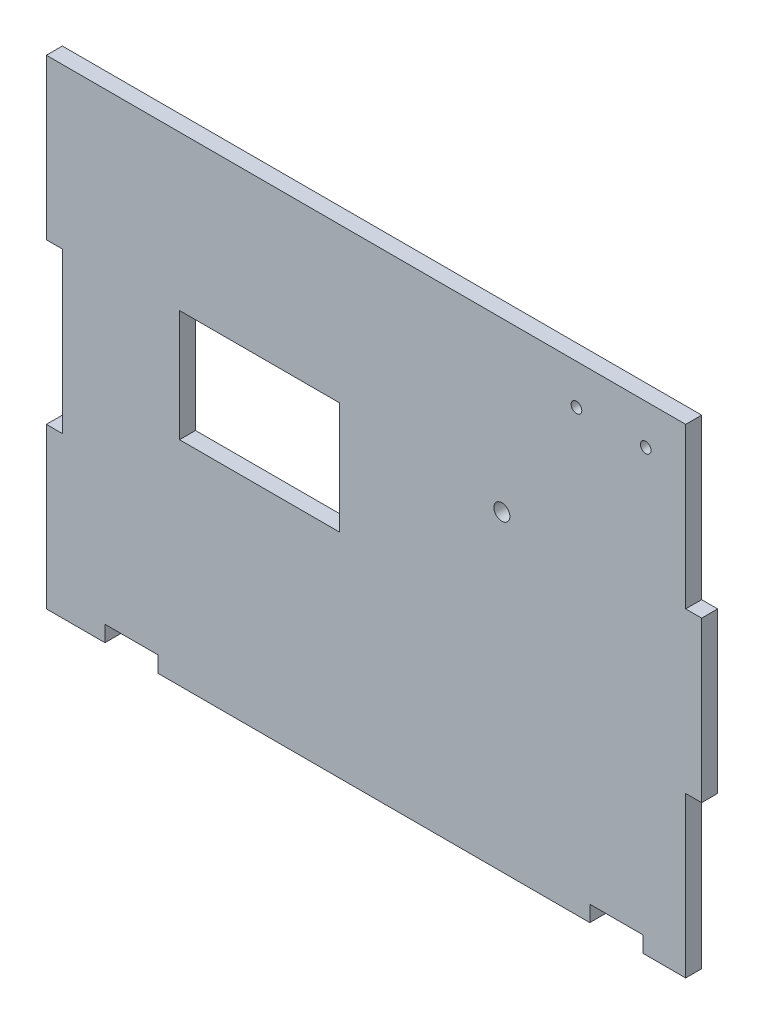
ISO-10303-21;
HEADER;
FILE_DESCRIPTION(('STEP AP214'),'2;1');
FILE_NAME('part.step','',(''),(''),'','','');
FILE_SCHEMA(('AUTOMOTIVE_DESIGN { 1 0 10303 214 1 1 1 1 }'));
ENDSEC;
DATA;
#1=APPLICATION_CONTEXT('core data for automotive mechanical design processes');
#2=APPLICATION_PROTOCOL_DEFINITION('international standard','automotive_design',2000,#1);
#3=PRODUCT_CONTEXT('',#1,'mechanical');
#4=PRODUCT('Part','Part','',(#3));
#5=PRODUCT_RELATED_PRODUCT_CATEGORY('part','',(#4));
#6=PRODUCT_DEFINITION_FORMATION('','',#4);
#7=PRODUCT_DEFINITION_CONTEXT('part definition',#1,'design');
#8=PRODUCT_DEFINITION('design','',#6,#7);
#9=PRODUCT_DEFINITION_SHAPE('','',#8);
#10=(LENGTH_UNIT() NAMED_UNIT(*) SI_UNIT(.MILLI.,.METRE.));
#11=(NAMED_UNIT(*) PLANE_ANGLE_UNIT() SI_UNIT($,.RADIAN.));
#12=(NAMED_UNIT(*) SI_UNIT($,.STERADIAN.) SOLID_ANGLE_UNIT());
#13=UNCERTAINTY_MEASURE_WITH_UNIT(LENGTH_MEASURE(1.E-05),#10,'distance_accuracy_value','');
#14=(GEOMETRIC_REPRESENTATION_CONTEXT(3) GLOBAL_UNCERTAINTY_ASSIGNED_CONTEXT((#13)) GLOBAL_UNIT_ASSIGNED_CONTEXT((#10,
#11,#12)) REPRESENTATION_CONTEXT('',''));
#15=CARTESIAN_POINT('',(0.,0.,0.));
#16=DIRECTION('',(0.,0.,1.));
#17=DIRECTION('',(1.,0.,0.));
#18=AXIS2_PLACEMENT_3D('',#15,#16,#17);
#19=CARTESIAN_POINT('',(0.,0.,3.));
#20=DIRECTION('',(0.,0.,-1.));
#21=DIRECTION('',(-1.,0.,0.));
#22=AXIS2_PLACEMENT_3D('',#19,#20,#21);
#23=PLANE('',#22);
#24=DIRECTION('',(1.,0.,0.));
#25=VECTOR('',#24,1.);
#26=CARTESIAN_POINT('',(-40.7927187305821,43.9131048744912,3.));
#27=LINE('',#26,#25);
#28=CARTESIAN_POINT('',(-40.7927187305821,43.9131048744912,3.));
#29=VERTEX_POINT('',#28);
#30=CARTESIAN_POINT('',(-30.7927187305821,43.9131048744912,3.));
#31=VERTEX_POINT('',#30);
#32=EDGE_CURVE('E233',#29,#31,#27,.T.);
#33=ORIENTED_EDGE('',*,*,#32,.T.);
#34=DIRECTION('',(0.,-1.,0.));
#35=VECTOR('',#34,1.);
#36=CARTESIAN_POINT('',(-30.7927187305821,43.9131048744912,3.));
#37=LINE('',#36,#35);
#38=CARTESIAN_POINT('',(-30.7927187305821,40.9131048744912,3.));
#39=VERTEX_POINT('',#38);
#40=EDGE_CURVE('E236',#31,#39,#37,.T.);
#41=ORIENTED_EDGE('',*,*,#40,.T.);
#42=DIRECTION('',(1.,0.,0.));
#43=VECTOR('',#42,1.);
#44=CARTESIAN_POINT('',(-30.7927187305821,40.9131048744912,3.));
#45=LINE('',#44,#43);
#46=CARTESIAN_POINT('',(50.2072812694179,40.9131048744912,3.));
#47=VERTEX_POINT('',#46);
#48=EDGE_CURVE('E239',#39,#47,#45,.T.);
#49=ORIENTED_EDGE('',*,*,#48,.T.);
#50=DIRECTION('',(0.,1.,0.));
#51=VECTOR('',#50,1.);
#52=CARTESIAN_POINT('',(50.2072812694179,40.9131048744912,3.));
#53=LINE('',#52,#51);
#54=CARTESIAN_POINT('',(50.2072812694179,43.9131048744912,3.));
#55=VERTEX_POINT('',#54);
#56=EDGE_CURVE('E241',#47,#55,#53,.T.);
#57=ORIENTED_EDGE('',*,*,#56,.T.);
#58=DIRECTION('',(1.,0.,0.));
#59=VECTOR('',#58,1.);
#60=CARTESIAN_POINT('',(50.2072812694179,43.9131048744912,3.));
#61=LINE('',#60,#59);
#62=CARTESIAN_POINT('',(60.2072812694179,43.9131048744912,3.));
#63=VERTEX_POINT('',#62);
#64=EDGE_CURVE('E243',#55,#63,#61,.T.);
#65=ORIENTED_EDGE('',*,*,#64,.T.);
#66=DIRECTION('',(0.,-1.,0.));
#67=VECTOR('',#66,1.);
#68=CARTESIAN_POINT('',(60.2072812694179,43.9131048744912,3.));
#69=LINE('',#68,#67);
#70=CARTESIAN_POINT('',(60.2072812694179,40.9131048744912,3.));
#71=VERTEX_POINT('',#70);
#72=EDGE_CURVE('E245',#63,#71,#69,.T.);
#73=ORIENTED_EDGE('',*,*,#72,.T.);
#74=DIRECTION('',(1.,0.,0.));
#75=VECTOR('',#74,1.);
#76=CARTESIAN_POINT('',(60.2072812694179,40.9131048744912,3.));
#77=LINE('',#76,#75);
#78=CARTESIAN_POINT('',(68.2072812694179,40.9131048744912,3.));
#79=VERTEX_POINT('',#78);
#80=EDGE_CURVE('E247',#71,#79,#77,.T.);
#81=ORIENTED_EDGE('',*,*,#80,.T.);
#82=DIRECTION('',(0.,1.,0.));
#83=VECTOR('',#82,1.);
#84=CARTESIAN_POINT('',(68.2072812694179,40.9131048744912,3.));
#85=LINE('',#84,#83);
#86=CARTESIAN_POINT('',(68.2072812694179,70.9131048744912,3.));
#87=VERTEX_POINT('',#86);
#88=EDGE_CURVE('E249',#79,#87,#85,.T.);
#89=ORIENTED_EDGE('',*,*,#88,.T.);
#90=DIRECTION('',(1.,0.,0.));
#91=VECTOR('',#90,1.);
#92=CARTESIAN_POINT('',(68.2072812694179,70.9131048744912,3.));
#93=LINE('',#92,#91);
#94=CARTESIAN_POINT('',(71.2072812694179,70.9131048744912,3.));
#95=VERTEX_POINT('',#94);
#96=EDGE_CURVE('E251',#87,#95,#93,.T.);
#97=ORIENTED_EDGE('',*,*,#96,.T.);
#98=DIRECTION('',(0.,1.,0.));
#99=VECTOR('',#98,1.);
#100=CARTESIAN_POINT('',(71.2072812694178,100.913104874491,3.));
#101=LINE('',#100,#99);
#102=CARTESIAN_POINT('',(71.2072812694178,100.913104874491,3.));
#103=VERTEX_POINT('',#102);
#104=EDGE_CURVE('E253',#95,#103,#101,.T.);
#105=ORIENTED_EDGE('',*,*,#104,.T.);
#106=DIRECTION('',(-1.,0.,0.));
#107=VECTOR('',#106,1.);
#108=CARTESIAN_POINT('',(71.2072812694178,100.913104874491,3.));
#109=LINE('',#108,#107);
#110=CARTESIAN_POINT('',(68.2072812694179,100.913104874491,3.));
#111=VERTEX_POINT('',#110);
#112=EDGE_CURVE('E255',#103,#111,#109,.T.);
#113=ORIENTED_EDGE('',*,*,#112,.T.);
#114=DIRECTION('',(0.,1.,0.));
#115=VECTOR('',#114,1.);
#116=CARTESIAN_POINT('',(68.2072812694179,100.913104874491,3.));
#117=LINE('',#116,#115);
#118=CARTESIAN_POINT('',(68.2072812694179,130.913104874491,3.));
#119=VERTEX_POINT('',#118);
#120=EDGE_CURVE('E257',#111,#119,#117,.T.);
#121=ORIENTED_EDGE('',*,*,#120,.T.);
#122=DIRECTION('',(-1.,0.,0.));
#123=VECTOR('',#122,1.);
#124=CARTESIAN_POINT('',(68.2072812694179,130.913104874491,3.));
#125=LINE('',#124,#123);
#126=CARTESIAN_POINT('',(-51.7927187305821,130.913104874491,3.));
#127=VERTEX_POINT('',#126);
#128=EDGE_CURVE('E259',#119,#127,#125,.T.);
#129=ORIENTED_EDGE('',*,*,#128,.T.);
#130=DIRECTION('',(0.,-1.,0.));
#131=VECTOR('',#130,1.);
#132=CARTESIAN_POINT('',(-51.7927187305821,100.913104874491,3.));
#133=LINE('',#132,#131);
#134=CARTESIAN_POINT('',(-51.7927187305821,100.913104874491,3.));
#135=VERTEX_POINT('',#134);
#136=EDGE_CURVE('E261',#127,#135,#133,.T.);
#137=ORIENTED_EDGE('',*,*,#136,.T.);
#138=DIRECTION('',(1.,0.,0.));
#139=VECTOR('',#138,1.);
#140=CARTESIAN_POINT('',(-51.7927187305821,100.913104874491,3.));
#141=LINE('',#140,#139);
#142=CARTESIAN_POINT('',(-48.7927187305821,100.913104874491,3.));
#143=VERTEX_POINT('',#142);
#144=EDGE_CURVE('E263',#135,#143,#141,.T.);
#145=ORIENTED_EDGE('',*,*,#144,.T.);
#146=DIRECTION('',(0.,-1.,0.));
#147=VECTOR('',#146,1.);
#148=CARTESIAN_POINT('',(-48.7927187305821,100.913104874491,3.));
#149=LINE('',#148,#147);
#150=CARTESIAN_POINT('',(-48.7927187305821,70.9131048744912,3.));
#151=VERTEX_POINT('',#150);
#152=EDGE_CURVE('E265',#143,#151,#149,.T.);
#153=ORIENTED_EDGE('',*,*,#152,.T.);
#154=DIRECTION('',(-1.,0.,0.));
#155=VECTOR('',#154,1.);
#156=CARTESIAN_POINT('',(-48.7927187305821,70.9131048744912,3.));
#157=LINE('',#156,#155);
#158=CARTESIAN_POINT('',(-51.7927187305821,70.9131048744912,3.));
#159=VERTEX_POINT('',#158);
#160=EDGE_CURVE('E267',#151,#159,#157,.T.);
#161=ORIENTED_EDGE('',*,*,#160,.T.);
#162=DIRECTION('',(0.,-1.,0.));
#163=VECTOR('',#162,1.);
#164=CARTESIAN_POINT('',(-51.7927187305821,70.9131048744912,3.));
#165=LINE('',#164,#163);
#166=CARTESIAN_POINT('',(-51.7927187305821,40.9131048744912,3.));
#167=VERTEX_POINT('',#166);
#168=EDGE_CURVE('E269',#159,#167,#165,.T.);
#169=ORIENTED_EDGE('',*,*,#168,.T.);
#170=DIRECTION('',(1.,0.,0.));
#171=VECTOR('',#170,1.);
#172=CARTESIAN_POINT('',(-51.7927187305821,40.9131048744912,3.));
#173=LINE('',#172,#171);
#174=CARTESIAN_POINT('',(-40.7927187305821,40.9131048744912,3.));
#175=VERTEX_POINT('',#174);
#176=EDGE_CURVE('E271',#167,#175,#173,.T.);
#177=ORIENTED_EDGE('',*,*,#176,.T.);
#178=DIRECTION('',(0.,1.,0.));
#179=VECTOR('',#178,1.);
#180=CARTESIAN_POINT('',(-40.7927187305821,40.9131048744912,3.));
#181=LINE('',#180,#179);
#182=EDGE_CURVE('E273',#175,#29,#181,.T.);
#183=ORIENTED_EDGE('',*,*,#182,.T.);
#184=EDGE_LOOP('',(#33,#41,#49,#57,#65,#73,#81,#89,#97,#105,#113,#121,#129,#137,#145,#153,#161,
#169,#177,#183));
#185=FACE_BOUND('',#184,.T.);
#186=DIRECTION('',(0.,-1.,0.));
#187=VECTOR('',#186,1.);
#188=CARTESIAN_POINT('',(-26.7927187305821,80.9131048744913,3.));
#189=LINE('',#188,#187);
#190=CARTESIAN_POINT('',(-26.7927187305821,101.913104874491,3.));
#191=VERTEX_POINT('',#190);
#192=CARTESIAN_POINT('',(-26.7927187305821,80.9131048744913,3.));
#193=VERTEX_POINT('',#192);
#194=EDGE_CURVE('E194',#191,#193,#189,.T.);
#195=ORIENTED_EDGE('',*,*,#194,.F.);
#196=DIRECTION('',(-1.,0.,0.));
#197=VECTOR('',#196,1.);
#198=CARTESIAN_POINT('',(-26.7927187305821,101.913104874491,3.));
#199=LINE('',#198,#197);
#200=CARTESIAN_POINT('',(3.20728126941788,101.913104874491,3.));
#201=VERTEX_POINT('',#200);
#202=EDGE_CURVE('E217',#201,#191,#199,.T.);
#203=ORIENTED_EDGE('',*,*,#202,.F.);
#204=DIRECTION('',(0.,1.,0.));
#205=VECTOR('',#204,1.);
#206=CARTESIAN_POINT('',(3.20728126941788,101.913104874491,3.));
#207=LINE('',#206,#205);
#208=CARTESIAN_POINT('',(3.20728126941789,80.9131048744913,3.));
#209=VERTEX_POINT('',#208);
#210=EDGE_CURVE('E215',#209,#201,#207,.T.);
#211=ORIENTED_EDGE('',*,*,#210,.F.);
#212=DIRECTION('',(1.,0.,0.));
#213=VECTOR('',#212,1.);
#214=CARTESIAN_POINT('',(3.20728126941789,80.9131048744913,3.));
#215=LINE('',#214,#213);
#216=EDGE_CURVE('E202',#193,#209,#215,.T.);
#217=ORIENTED_EDGE('',*,*,#216,.F.);
#218=EDGE_LOOP('',(#195,#203,#211,#217));
#219=FACE_BOUND('',#218,.T.);
#220=CARTESIAN_POINT('',(47.7072812694179,123.413104874491,3.));
#221=DIRECTION('',(0.,0.,1.));
#222=DIRECTION('',(1.,0.,0.));
#223=AXIS2_PLACEMENT_3D('',#220,#221,#222);
#224=CIRCLE('',#223,0.999999999999998);
#225=CARTESIAN_POINT('',(48.7072812694179,123.413104874491,3.));
#226=VERTEX_POINT('',#225);
#227=EDGE_CURVE('E223',#226,#226,#224,.T.);
#228=ORIENTED_EDGE('',*,*,#227,.F.);
#229=EDGE_LOOP('',(#228));
#230=FACE_BOUND('',#229,.T.);
#231=CARTESIAN_POINT('',(60.7072812694179,123.413104874491,3.));
#232=DIRECTION('',(0.,0.,1.));
#233=DIRECTION('',(1.,0.,0.));
#234=AXIS2_PLACEMENT_3D('',#231,#232,#233);
#235=CIRCLE('',#234,0.999999999999998);
#236=CARTESIAN_POINT('',(61.7072812694179,123.413104874491,3.));
#237=VERTEX_POINT('',#236);
#238=EDGE_CURVE('E727',#237,#237,#235,.T.);
#239=ORIENTED_EDGE('',*,*,#238,.F.);
#240=EDGE_LOOP('',(#239));
#241=FACE_BOUND('',#240,.T.);
#242=CARTESIAN_POINT('',(33.7072812694179,99.4131048744913,3.));
#243=DIRECTION('',(0.,0.,1.));
#244=DIRECTION('',(1.,0.,0.));
#245=AXIS2_PLACEMENT_3D('',#242,#243,#244);
#246=CIRCLE('',#245,1.5);
#247=CARTESIAN_POINT('',(35.2072812694179,99.4131048744913,3.));
#248=VERTEX_POINT('',#247);
#249=EDGE_CURVE('E718',#248,#248,#246,.T.);
#250=ORIENTED_EDGE('',*,*,#249,.F.);
#251=EDGE_LOOP('',(#250));
#252=FACE_BOUND('',#251,.T.);
#253=ADVANCED_FACE('F33',(#185,#219,#230,#241,#252),#23,.F.);
#254=CARTESIAN_POINT('',(0.,0.,0.));
#255=DIRECTION('',(0.,0.,-1.));
#256=DIRECTION('',(-1.,0.,0.));
#257=AXIS2_PLACEMENT_3D('',#254,#255,#256);
#258=PLANE('',#257);
#259=CARTESIAN_POINT('',(60.7072812694179,123.413104874491,0.));
#260=DIRECTION('',(0.,0.,1.));
#261=DIRECTION('',(1.,0.,0.));
#262=AXIS2_PLACEMENT_3D('',#259,#260,#261);
#263=CIRCLE('',#262,0.999999999999998);
#264=CARTESIAN_POINT('',(61.7072812694179,123.413104874491,0.));
#265=VERTEX_POINT('',#264);
#266=EDGE_CURVE('E724',#265,#265,#263,.T.);
#267=ORIENTED_EDGE('',*,*,#266,.T.);
#268=EDGE_LOOP('',(#267));
#269=FACE_BOUND('',#268,.T.);
#270=DIRECTION('',(-1.,0.,0.));
#271=VECTOR('',#270,1.);
#272=CARTESIAN_POINT('',(-26.7927187305821,101.913104874491,0.));
#273=LINE('',#272,#271);
#274=CARTESIAN_POINT('',(3.20728126941788,101.913104874491,0.));
#275=VERTEX_POINT('',#274);
#276=CARTESIAN_POINT('',(-26.7927187305821,101.913104874491,0.));
#277=VERTEX_POINT('',#276);
#278=EDGE_CURVE('E203',#275,#277,#273,.T.);
#279=ORIENTED_EDGE('',*,*,#278,.T.);
#280=DIRECTION('',(0.,-1.,0.));
#281=VECTOR('',#280,1.);
#282=CARTESIAN_POINT('',(-26.7927187305821,80.9131048744913,0.));
#283=LINE('',#282,#281);
#284=CARTESIAN_POINT('',(-26.7927187305821,80.9131048744913,0.));
#285=VERTEX_POINT('',#284);
#286=EDGE_CURVE('E56',#277,#285,#283,.T.);
#287=ORIENTED_EDGE('',*,*,#286,.T.);
#288=DIRECTION('',(1.,0.,0.));
#289=VECTOR('',#288,1.);
#290=CARTESIAN_POINT('',(3.20728126941789,80.9131048744913,0.));
#291=LINE('',#290,#289);
#292=CARTESIAN_POINT('',(3.20728126941789,80.9131048744913,0.));
#293=VERTEX_POINT('',#292);
#294=EDGE_CURVE('E209',#285,#293,#291,.T.);
#295=ORIENTED_EDGE('',*,*,#294,.T.);
#296=DIRECTION('',(0.,1.,0.));
#297=VECTOR('',#296,1.);
#298=CARTESIAN_POINT('',(3.20728126941788,101.913104874491,0.));
#299=LINE('',#298,#297);
#300=EDGE_CURVE('E225',#293,#275,#299,.T.);
#301=ORIENTED_EDGE('',*,*,#300,.T.);
#302=EDGE_LOOP('',(#279,#287,#295,#301));
#303=FACE_BOUND('',#302,.T.);
#304=DIRECTION('',(1.,0.,0.));
#305=VECTOR('',#304,1.);
#306=CARTESIAN_POINT('',(-40.7927187305821,43.9131048744912,0.));
#307=LINE('',#306,#305);
#308=CARTESIAN_POINT('',(-40.7927187305821,43.9131048744912,0.));
#309=VERTEX_POINT('',#308);
#310=CARTESIAN_POINT('',(-30.7927187305821,43.9131048744912,0.));
#311=VERTEX_POINT('',#310);
#312=EDGE_CURVE('E210',#309,#311,#307,.T.);
#313=ORIENTED_EDGE('',*,*,#312,.F.);
#314=DIRECTION('',(0.,1.,0.));
#315=VECTOR('',#314,1.);
#316=CARTESIAN_POINT('',(-40.7927187305821,40.9131048744912,0.));
#317=LINE('',#316,#315);
#318=CARTESIAN_POINT('',(-40.7927187305821,40.9131048744912,0.));
#319=VERTEX_POINT('',#318);
#320=EDGE_CURVE('E237',#319,#309,#317,.T.);
#321=ORIENTED_EDGE('',*,*,#320,.F.);
#322=DIRECTION('',(1.,0.,0.));
#323=VECTOR('',#322,1.);
#324=CARTESIAN_POINT('',(-51.7927187305821,40.9131048744912,0.));
#325=LINE('',#324,#323);
#326=CARTESIAN_POINT('',(-51.7927187305821,40.9131048744912,0.));
#327=VERTEX_POINT('',#326);
#328=EDGE_CURVE('E312',#327,#319,#325,.T.);
#329=ORIENTED_EDGE('',*,*,#328,.F.);
#330=DIRECTION('',(0.,-1.,0.));
#331=VECTOR('',#330,1.);
#332=CARTESIAN_POINT('',(-51.7927187305821,70.9131048744912,0.));
#333=LINE('',#332,#331);
#334=CARTESIAN_POINT('',(-51.7927187305821,70.9131048744912,0.));
#335=VERTEX_POINT('',#334);
#336=EDGE_CURVE('E310',#335,#327,#333,.T.);
#337=ORIENTED_EDGE('',*,*,#336,.F.);
#338=DIRECTION('',(-1.,0.,0.));
#339=VECTOR('',#338,1.);
#340=CARTESIAN_POINT('',(-48.7927187305821,70.9131048744912,0.));
#341=LINE('',#340,#339);
#342=CARTESIAN_POINT('',(-48.7927187305821,70.9131048744912,0.));
#343=VERTEX_POINT('',#342);
#344=EDGE_CURVE('E308',#343,#335,#341,.T.);
#345=ORIENTED_EDGE('',*,*,#344,.F.);
#346=DIRECTION('',(0.,-1.,0.));
#347=VECTOR('',#346,1.);
#348=CARTESIAN_POINT('',(-48.7927187305821,100.913104874491,0.));
#349=LINE('',#348,#347);
#350=CARTESIAN_POINT('',(-48.7927187305821,100.913104874491,0.));
#351=VERTEX_POINT('',#350);
#352=EDGE_CURVE('E306',#351,#343,#349,.T.);
#353=ORIENTED_EDGE('',*,*,#352,.F.);
#354=DIRECTION('',(1.,0.,0.));
#355=VECTOR('',#354,1.);
#356=CARTESIAN_POINT('',(-51.7927187305821,100.913104874491,0.));
#357=LINE('',#356,#355);
#358=CARTESIAN_POINT('',(-51.7927187305821,100.913104874491,0.));
#359=VERTEX_POINT('',#358);
#360=EDGE_CURVE('E304',#359,#351,#357,.T.);
#361=ORIENTED_EDGE('',*,*,#360,.F.);
#362=DIRECTION('',(0.,-1.,0.));
#363=VECTOR('',#362,1.);
#364=CARTESIAN_POINT('',(-51.7927187305821,100.913104874491,0.));
#365=LINE('',#364,#363);
#366=CARTESIAN_POINT('',(-51.7927187305821,130.913104874491,0.));
#367=VERTEX_POINT('',#366);
#368=EDGE_CURVE('E302',#367,#359,#365,.T.);
#369=ORIENTED_EDGE('',*,*,#368,.F.);
#370=DIRECTION('',(-1.,0.,0.));
#371=VECTOR('',#370,1.);
#372=CARTESIAN_POINT('',(68.2072812694179,130.913104874491,0.));
#373=LINE('',#372,#371);
#374=CARTESIAN_POINT('',(68.2072812694179,130.913104874491,0.));
#375=VERTEX_POINT('',#374);
#376=EDGE_CURVE('E300',#375,#367,#373,.T.);
#377=ORIENTED_EDGE('',*,*,#376,.F.);
#378=DIRECTION('',(0.,1.,0.));
#379=VECTOR('',#378,1.);
#380=CARTESIAN_POINT('',(68.2072812694179,100.913104874491,0.));
#381=LINE('',#380,#379);
#382=CARTESIAN_POINT('',(68.2072812694179,100.913104874491,0.));
#383=VERTEX_POINT('',#382);
#384=EDGE_CURVE('E298',#383,#375,#381,.T.);
#385=ORIENTED_EDGE('',*,*,#384,.F.);
#386=DIRECTION('',(-1.,0.,0.));
#387=VECTOR('',#386,1.);
#388=CARTESIAN_POINT('',(71.2072812694178,100.913104874491,0.));
#389=LINE('',#388,#387);
#390=CARTESIAN_POINT('',(71.2072812694178,100.913104874491,0.));
#391=VERTEX_POINT('',#390);
#392=EDGE_CURVE('E296',#391,#383,#389,.T.);
#393=ORIENTED_EDGE('',*,*,#392,.F.);
#394=DIRECTION('',(0.,1.,0.));
#395=VECTOR('',#394,1.);
#396=CARTESIAN_POINT('',(71.2072812694178,100.913104874491,0.));
#397=LINE('',#396,#395);
#398=CARTESIAN_POINT('',(71.2072812694179,70.9131048744912,0.));
#399=VERTEX_POINT('',#398);
#400=EDGE_CURVE('E294',#399,#391,#397,.T.);
#401=ORIENTED_EDGE('',*,*,#400,.F.);
#402=DIRECTION('',(1.,0.,0.));
#403=VECTOR('',#402,1.);
#404=CARTESIAN_POINT('',(68.2072812694179,70.9131048744912,0.));
#405=LINE('',#404,#403);
#406=CARTESIAN_POINT('',(68.2072812694179,70.9131048744912,0.));
#407=VERTEX_POINT('',#406);
#408=EDGE_CURVE('E292',#407,#399,#405,.T.);
#409=ORIENTED_EDGE('',*,*,#408,.F.);
#410=DIRECTION('',(0.,1.,0.));
#411=VECTOR('',#410,1.);
#412=CARTESIAN_POINT('',(68.2072812694179,40.9131048744912,0.));
#413=LINE('',#412,#411);
#414=CARTESIAN_POINT('',(68.2072812694179,40.9131048744912,0.));
#415=VERTEX_POINT('',#414);
#416=EDGE_CURVE('E290',#415,#407,#413,.T.);
#417=ORIENTED_EDGE('',*,*,#416,.F.);
#418=DIRECTION('',(1.,0.,0.));
#419=VECTOR('',#418,1.);
#420=CARTESIAN_POINT('',(60.2072812694179,40.9131048744912,0.));
#421=LINE('',#420,#419);
#422=CARTESIAN_POINT('',(60.2072812694179,40.9131048744912,0.));
#423=VERTEX_POINT('',#422);
#424=EDGE_CURVE('E288',#423,#415,#421,.T.);
#425=ORIENTED_EDGE('',*,*,#424,.F.);
#426=DIRECTION('',(0.,-1.,0.));
#427=VECTOR('',#426,1.);
#428=CARTESIAN_POINT('',(60.2072812694179,43.9131048744912,0.));
#429=LINE('',#428,#427);
#430=CARTESIAN_POINT('',(60.2072812694179,43.9131048744912,0.));
#431=VERTEX_POINT('',#430);
#432=EDGE_CURVE('E286',#431,#423,#429,.T.);
#433=ORIENTED_EDGE('',*,*,#432,.F.);
#434=DIRECTION('',(1.,0.,0.));
#435=VECTOR('',#434,1.);
#436=CARTESIAN_POINT('',(50.2072812694179,43.9131048744912,0.));
#437=LINE('',#436,#435);
#438=CARTESIAN_POINT('',(50.2072812694179,43.9131048744912,0.));
#439=VERTEX_POINT('',#438);
#440=EDGE_CURVE('E284',#439,#431,#437,.T.);
#441=ORIENTED_EDGE('',*,*,#440,.F.);
#442=DIRECTION('',(0.,1.,0.));
#443=VECTOR('',#442,1.);
#444=CARTESIAN_POINT('',(50.2072812694179,40.9131048744912,0.));
#445=LINE('',#444,#443);
#446=CARTESIAN_POINT('',(50.2072812694179,40.9131048744912,0.));
#447=VERTEX_POINT('',#446);
#448=EDGE_CURVE('E282',#447,#439,#445,.T.);
#449=ORIENTED_EDGE('',*,*,#448,.F.);
#450=DIRECTION('',(1.,0.,0.));
#451=VECTOR('',#450,1.);
#452=CARTESIAN_POINT('',(-30.7927187305821,40.9131048744912,0.));
#453=LINE('',#452,#451);
#454=CARTESIAN_POINT('',(-30.7927187305821,40.9131048744912,0.));
#455=VERTEX_POINT('',#454);
#456=EDGE_CURVE('E280',#455,#447,#453,.T.);
#457=ORIENTED_EDGE('',*,*,#456,.F.);
#458=DIRECTION('',(0.,-1.,0.));
#459=VECTOR('',#458,1.);
#460=CARTESIAN_POINT('',(-30.7927187305821,43.9131048744912,0.));
#461=LINE('',#460,#459);
#462=EDGE_CURVE('E278',#311,#455,#461,.T.);
#463=ORIENTED_EDGE('',*,*,#462,.F.);
#464=EDGE_LOOP('',(#313,#321,#329,#337,#345,#353,#361,#369,#377,#385,#393,#401,#409,#417,#425,
#433,#441,#449,#457,#463));
#465=FACE_BOUND('',#464,.T.);
#466=CARTESIAN_POINT('',(47.7072812694179,123.413104874491,0.));
#467=DIRECTION('',(0.,0.,1.));
#468=DIRECTION('',(1.,0.,0.));
#469=AXIS2_PLACEMENT_3D('',#466,#467,#468);
#470=CIRCLE('',#469,0.999999999999998);
#471=CARTESIAN_POINT('',(48.7072812694179,123.413104874491,0.));
#472=VERTEX_POINT('',#471);
#473=EDGE_CURVE('E730',#472,#472,#470,.T.);
#474=ORIENTED_EDGE('',*,*,#473,.T.);
#475=EDGE_LOOP('',(#474));
#476=FACE_BOUND('',#475,.T.);
#477=CARTESIAN_POINT('',(33.7072812694179,99.4131048744913,0.));
#478=DIRECTION('',(0.,0.,1.));
#479=DIRECTION('',(1.,0.,0.));
#480=AXIS2_PLACEMENT_3D('',#477,#478,#479);
#481=CIRCLE('',#480,1.5);
#482=CARTESIAN_POINT('',(35.2072812694179,99.4131048744913,0.));
#483=VERTEX_POINT('',#482);
#484=EDGE_CURVE('E721',#483,#483,#481,.T.);
#485=ORIENTED_EDGE('',*,*,#484,.T.);
#486=EDGE_LOOP('',(#485));
#487=FACE_BOUND('',#486,.T.);
#488=ADVANCED_FACE('F378',(#269,#303,#465,#476,#487),#258,.T.);
#489=CARTESIAN_POINT('',(-40.7927187305821,43.9131048744912,3.));
#490=DIRECTION('',(0.,1.,0.));
#491=DIRECTION('',(0.,0.,1.));
#492=AXIS2_PLACEMENT_3D('',#489,#490,#491);
#493=PLANE('',#492);
#494=ORIENTED_EDGE('',*,*,#312,.T.);
#495=DIRECTION('',(0.,0.,-1.));
#496=VECTOR('',#495,1.);
#497=CARTESIAN_POINT('',(-30.7927187305821,43.9131048744912,3.));
#498=LINE('',#497,#496);
#499=EDGE_CURVE('E11',#31,#311,#498,.T.);
#500=ORIENTED_EDGE('',*,*,#499,.F.);
#501=ORIENTED_EDGE('',*,*,#32,.F.);
#502=DIRECTION('',(0.,0.,-1.));
#503=VECTOR('',#502,1.);
#504=CARTESIAN_POINT('',(-40.7927187305821,43.9131048744912,3.));
#505=LINE('',#504,#503);
#506=EDGE_CURVE('E275',#29,#309,#505,.T.);
#507=ORIENTED_EDGE('',*,*,#506,.T.);
#508=EDGE_LOOP('',(#494,#500,#501,#507));
#509=FACE_BOUND('',#508,.T.);
#510=ADVANCED_FACE('F35',(#509),#493,.F.);
#511=CARTESIAN_POINT('',(-30.7927187305821,43.9131048744912,3.));
#512=DIRECTION('',(1.,0.,0.));
#513=DIRECTION('',(0.,0.,-1.));
#514=AXIS2_PLACEMENT_3D('',#511,#512,#513);
#515=PLANE('',#514);
#516=ORIENTED_EDGE('',*,*,#462,.T.);
#517=DIRECTION('',(0.,0.,-1.));
#518=VECTOR('',#517,1.);
#519=CARTESIAN_POINT('',(-30.7927187305821,40.9131048744912,3.));
#520=LINE('',#519,#518);
#521=EDGE_CURVE('E41',#39,#455,#520,.T.);
#522=ORIENTED_EDGE('',*,*,#521,.F.);
#523=ORIENTED_EDGE('',*,*,#40,.F.);
#524=ORIENTED_EDGE('',*,*,#499,.T.);
#525=EDGE_LOOP('',(#516,#522,#523,#524));
#526=FACE_BOUND('',#525,.T.);
#527=ADVANCED_FACE('F395',(#526),#515,.F.);
#528=CARTESIAN_POINT('',(-30.7927187305821,40.9131048744912,3.));
#529=DIRECTION('',(0.,1.,0.));
#530=DIRECTION('',(0.,0.,1.));
#531=AXIS2_PLACEMENT_3D('',#528,#529,#530);
#532=PLANE('',#531);
#533=ORIENTED_EDGE('',*,*,#456,.T.);
#534=DIRECTION('',(0.,0.,-1.));
#535=VECTOR('',#534,1.);
#536=CARTESIAN_POINT('',(50.2072812694179,40.9131048744912,3.));
#537=LINE('',#536,#535);
#538=EDGE_CURVE('E365',#47,#447,#537,.T.);
#539=ORIENTED_EDGE('',*,*,#538,.F.);
#540=ORIENTED_EDGE('',*,*,#48,.F.);
#541=ORIENTED_EDGE('',*,*,#521,.T.);
#542=EDGE_LOOP('',(#533,#539,#540,#541));
#543=FACE_BOUND('',#542,.T.);
#544=ADVANCED_FACE('F372',(#543),#532,.F.);
#545=CARTESIAN_POINT('',(50.2072812694179,40.9131048744912,3.));
#546=DIRECTION('',(-1.,0.,0.));
#547=DIRECTION('',(0.,-1.,0.));
#548=AXIS2_PLACEMENT_3D('',#545,#546,#547);
#549=PLANE('',#548);
#550=ORIENTED_EDGE('',*,*,#448,.T.);
#551=DIRECTION('',(0.,0.,-1.));
#552=VECTOR('',#551,1.);
#553=CARTESIAN_POINT('',(50.2072812694179,43.9131048744912,3.));
#554=LINE('',#553,#552);
#555=EDGE_CURVE('E362',#55,#439,#554,.T.);
#556=ORIENTED_EDGE('',*,*,#555,.F.);
#557=ORIENTED_EDGE('',*,*,#56,.F.);
#558=ORIENTED_EDGE('',*,*,#538,.T.);
#559=EDGE_LOOP('',(#550,#556,#557,#558));
#560=FACE_BOUND('',#559,.T.);
#561=ADVANCED_FACE('F384',(#560),#549,.F.);
#562=CARTESIAN_POINT('',(50.2072812694179,43.9131048744912,3.));
#563=DIRECTION('',(0.,1.,0.));
#564=DIRECTION('',(-1.,0.,0.));
#565=AXIS2_PLACEMENT_3D('',#562,#563,#564);
#566=PLANE('',#565);
#567=ORIENTED_EDGE('',*,*,#440,.T.);
#568=DIRECTION('',(0.,0.,-1.));
#569=VECTOR('',#568,1.);
#570=CARTESIAN_POINT('',(60.2072812694179,43.9131048744912,3.));
#571=LINE('',#570,#569);
#572=EDGE_CURVE('E359',#63,#431,#571,.T.);
#573=ORIENTED_EDGE('',*,*,#572,.F.);
#574=ORIENTED_EDGE('',*,*,#64,.F.);
#575=ORIENTED_EDGE('',*,*,#555,.T.);
#576=EDGE_LOOP('',(#567,#573,#574,#575));
#577=FACE_BOUND('',#576,.T.);
#578=ADVANCED_FACE('F388',(#577),#566,.F.);
#579=CARTESIAN_POINT('',(60.2072812694179,43.9131048744912,3.));
#580=DIRECTION('',(1.,0.,0.));
#581=DIRECTION('',(0.,1.,0.));
#582=AXIS2_PLACEMENT_3D('',#579,#580,#581);
#583=PLANE('',#582);
#584=ORIENTED_EDGE('',*,*,#432,.T.);
#585=DIRECTION('',(0.,0.,-1.));
#586=VECTOR('',#585,1.);
#587=CARTESIAN_POINT('',(60.2072812694179,40.9131048744912,3.));
#588=LINE('',#587,#586);
#589=EDGE_CURVE('E356',#71,#423,#588,.T.);
#590=ORIENTED_EDGE('',*,*,#589,.F.);
#591=ORIENTED_EDGE('',*,*,#72,.F.);
#592=ORIENTED_EDGE('',*,*,#572,.T.);
#593=EDGE_LOOP('',(#584,#590,#591,#592));
#594=FACE_BOUND('',#593,.T.);
#595=ADVANCED_FACE('F468',(#594),#583,.F.);
#596=CARTESIAN_POINT('',(60.2072812694179,40.9131048744912,3.));
#597=DIRECTION('',(0.,1.,0.));
#598=DIRECTION('',(-1.,0.,0.));
#599=AXIS2_PLACEMENT_3D('',#596,#597,#598);
#600=PLANE('',#599);
#601=ORIENTED_EDGE('',*,*,#424,.T.);
#602=DIRECTION('',(0.,0.,-1.));
#603=VECTOR('',#602,1.);
#604=CARTESIAN_POINT('',(68.2072812694179,40.9131048744912,3.));
#605=LINE('',#604,#603);
#606=EDGE_CURVE('E353',#79,#415,#605,.T.);
#607=ORIENTED_EDGE('',*,*,#606,.F.);
#608=ORIENTED_EDGE('',*,*,#80,.F.);
#609=ORIENTED_EDGE('',*,*,#589,.T.);
#610=EDGE_LOOP('',(#601,#607,#608,#609));
#611=FACE_BOUND('',#610,.T.);
#612=ADVANCED_FACE('F466',(#611),#600,.F.);
#613=CARTESIAN_POINT('',(68.2072812694179,40.9131048744912,3.));
#614=DIRECTION('',(-1.,0.,0.));
#615=DIRECTION('',(0.,-1.,0.));
#616=AXIS2_PLACEMENT_3D('',#613,#614,#615);
#617=PLANE('',#616);
#618=ORIENTED_EDGE('',*,*,#416,.T.);
#619=DIRECTION('',(0.,0.,-1.));
#620=VECTOR('',#619,1.);
#621=CARTESIAN_POINT('',(68.2072812694179,70.9131048744912,3.));
#622=LINE('',#621,#620);
#623=EDGE_CURVE('E350',#87,#407,#622,.T.);
#624=ORIENTED_EDGE('',*,*,#623,.F.);
#625=ORIENTED_EDGE('',*,*,#88,.F.);
#626=ORIENTED_EDGE('',*,*,#606,.T.);
#627=EDGE_LOOP('',(#618,#624,#625,#626));
#628=FACE_BOUND('',#627,.T.);
#629=ADVANCED_FACE('F461',(#628),#617,.F.);
#630=CARTESIAN_POINT('',(68.2072812694179,70.9131048744912,3.));
#631=DIRECTION('',(0.,1.,0.));
#632=DIRECTION('',(-1.,0.,0.));
#633=AXIS2_PLACEMENT_3D('',#630,#631,#632);
#634=PLANE('',#633);
#635=ORIENTED_EDGE('',*,*,#408,.T.);
#636=DIRECTION('',(0.,0.,-1.));
#637=VECTOR('',#636,1.);
#638=CARTESIAN_POINT('',(71.2072812694179,70.9131048744912,3.));
#639=LINE('',#638,#637);
#640=EDGE_CURVE('E347',#95,#399,#639,.T.);
#641=ORIENTED_EDGE('',*,*,#640,.F.);
#642=ORIENTED_EDGE('',*,*,#96,.F.);
#643=ORIENTED_EDGE('',*,*,#623,.T.);
#644=EDGE_LOOP('',(#635,#641,#642,#643));
#645=FACE_BOUND('',#644,.T.);
#646=ADVANCED_FACE('F456',(#645),#634,.F.);
#647=CARTESIAN_POINT('',(71.2072812694178,100.913104874491,3.));
#648=DIRECTION('',(-1.,0.,0.));
#649=DIRECTION('',(0.,-1.,0.));
#650=AXIS2_PLACEMENT_3D('',#647,#648,#649);
#651=PLANE('',#650);
#652=ORIENTED_EDGE('',*,*,#400,.T.);
#653=DIRECTION('',(0.,0.,-1.));
#654=VECTOR('',#653,1.);
#655=CARTESIAN_POINT('',(71.2072812694178,100.913104874491,3.));
#656=LINE('',#655,#654);
#657=EDGE_CURVE('E344',#103,#391,#656,.T.);
#658=ORIENTED_EDGE('',*,*,#657,.F.);
#659=ORIENTED_EDGE('',*,*,#104,.F.);
#660=ORIENTED_EDGE('',*,*,#640,.T.);
#661=EDGE_LOOP('',(#652,#658,#659,#660));
#662=FACE_BOUND('',#661,.T.);
#663=ADVANCED_FACE('F452',(#662),#651,.F.);
#664=CARTESIAN_POINT('',(71.2072812694178,100.913104874491,3.));
#665=DIRECTION('',(0.,-1.,0.));
#666=DIRECTION('',(1.,0.,0.));
#667=AXIS2_PLACEMENT_3D('',#664,#665,#666);
#668=PLANE('',#667);
#669=ORIENTED_EDGE('',*,*,#392,.T.);
#670=DIRECTION('',(0.,0.,-1.));
#671=VECTOR('',#670,1.);
#672=CARTESIAN_POINT('',(68.2072812694179,100.913104874491,3.));
#673=LINE('',#672,#671);
#674=EDGE_CURVE('E341',#111,#383,#673,.T.);
#675=ORIENTED_EDGE('',*,*,#674,.F.);
#676=ORIENTED_EDGE('',*,*,#112,.F.);
#677=ORIENTED_EDGE('',*,*,#657,.T.);
#678=EDGE_LOOP('',(#669,#675,#676,#677));
#679=FACE_BOUND('',#678,.T.);
#680=ADVANCED_FACE('F447',(#679),#668,.F.);
#681=CARTESIAN_POINT('',(68.2072812694179,100.913104874491,3.));
#682=DIRECTION('',(-1.,0.,0.));
#683=DIRECTION('',(0.,-1.,0.));
#684=AXIS2_PLACEMENT_3D('',#681,#682,#683);
#685=PLANE('',#684);
#686=ORIENTED_EDGE('',*,*,#384,.T.);
#687=DIRECTION('',(0.,0.,-1.));
#688=VECTOR('',#687,1.);
#689=CARTESIAN_POINT('',(68.2072812694179,130.913104874491,3.));
#690=LINE('',#689,#688);
#691=EDGE_CURVE('E338',#119,#375,#690,.T.);
#692=ORIENTED_EDGE('',*,*,#691,.F.);
#693=ORIENTED_EDGE('',*,*,#120,.F.);
#694=ORIENTED_EDGE('',*,*,#674,.T.);
#695=EDGE_LOOP('',(#686,#692,#693,#694));
#696=FACE_BOUND('',#695,.T.);
#697=ADVANCED_FACE('F441',(#696),#685,.F.);
#698=CARTESIAN_POINT('',(68.2072812694179,130.913104874491,3.));
#699=DIRECTION('',(0.,-1.,0.));
#700=DIRECTION('',(1.,0.,0.));
#701=AXIS2_PLACEMENT_3D('',#698,#699,#700);
#702=PLANE('',#701);
#703=ORIENTED_EDGE('',*,*,#376,.T.);
#704=DIRECTION('',(0.,0.,-1.));
#705=VECTOR('',#704,1.);
#706=CARTESIAN_POINT('',(-51.7927187305821,130.913104874491,3.));
#707=LINE('',#706,#705);
#708=EDGE_CURVE('E335',#127,#367,#707,.T.);
#709=ORIENTED_EDGE('',*,*,#708,.F.);
#710=ORIENTED_EDGE('',*,*,#128,.F.);
#711=ORIENTED_EDGE('',*,*,#691,.T.);
#712=EDGE_LOOP('',(#703,#709,#710,#711));
#713=FACE_BOUND('',#712,.T.);
#714=ADVANCED_FACE('F437',(#713),#702,.F.);
#715=CARTESIAN_POINT('',(-51.7927187305821,100.913104874491,3.));
#716=DIRECTION('',(1.,0.,0.));
#717=DIRECTION('',(0.,1.,0.));
#718=AXIS2_PLACEMENT_3D('',#715,#716,#717);
#719=PLANE('',#718);
#720=ORIENTED_EDGE('',*,*,#368,.T.);
#721=DIRECTION('',(0.,0.,-1.));
#722=VECTOR('',#721,1.);
#723=CARTESIAN_POINT('',(-51.7927187305821,100.913104874491,3.));
#724=LINE('',#723,#722);
#725=EDGE_CURVE('E332',#135,#359,#724,.T.);
#726=ORIENTED_EDGE('',*,*,#725,.F.);
#727=ORIENTED_EDGE('',*,*,#136,.F.);
#728=ORIENTED_EDGE('',*,*,#708,.T.);
#729=EDGE_LOOP('',(#720,#726,#727,#728));
#730=FACE_BOUND('',#729,.T.);
#731=ADVANCED_FACE('F432',(#730),#719,.F.);
#732=CARTESIAN_POINT('',(-51.7927187305821,100.913104874491,3.));
#733=DIRECTION('',(0.,1.,0.));
#734=DIRECTION('',(-1.,0.,0.));
#735=AXIS2_PLACEMENT_3D('',#732,#733,#734);
#736=PLANE('',#735);
#737=ORIENTED_EDGE('',*,*,#360,.T.);
#738=DIRECTION('',(0.,0.,-1.));
#739=VECTOR('',#738,1.);
#740=CARTESIAN_POINT('',(-48.7927187305821,100.913104874491,3.));
#741=LINE('',#740,#739);
#742=EDGE_CURVE('E329',#143,#351,#741,.T.);
#743=ORIENTED_EDGE('',*,*,#742,.F.);
#744=ORIENTED_EDGE('',*,*,#144,.F.);
#745=ORIENTED_EDGE('',*,*,#725,.T.);
#746=EDGE_LOOP('',(#737,#743,#744,#745));
#747=FACE_BOUND('',#746,.T.);
#748=ADVANCED_FACE('F426',(#747),#736,.F.);
#749=CARTESIAN_POINT('',(-48.7927187305821,100.913104874491,3.));
#750=DIRECTION('',(1.,0.,0.));
#751=DIRECTION('',(0.,1.,0.));
#752=AXIS2_PLACEMENT_3D('',#749,#750,#751);
#753=PLANE('',#752);
#754=ORIENTED_EDGE('',*,*,#352,.T.);
#755=DIRECTION('',(0.,0.,-1.));
#756=VECTOR('',#755,1.);
#757=CARTESIAN_POINT('',(-48.7927187305821,70.9131048744912,3.));
#758=LINE('',#757,#756);
#759=EDGE_CURVE('E326',#151,#343,#758,.T.);
#760=ORIENTED_EDGE('',*,*,#759,.F.);
#761=ORIENTED_EDGE('',*,*,#152,.F.);
#762=ORIENTED_EDGE('',*,*,#742,.T.);
#763=EDGE_LOOP('',(#754,#760,#761,#762));
#764=FACE_BOUND('',#763,.T.);
#765=ADVANCED_FACE('F422',(#764),#753,.F.);
#766=CARTESIAN_POINT('',(-48.7927187305821,70.9131048744912,3.));
#767=DIRECTION('',(0.,-1.,0.));
#768=DIRECTION('',(0.,0.,-1.));
#769=AXIS2_PLACEMENT_3D('',#766,#767,#768);
#770=PLANE('',#769);
#771=ORIENTED_EDGE('',*,*,#344,.T.);
#772=DIRECTION('',(0.,0.,-1.));
#773=VECTOR('',#772,1.);
#774=CARTESIAN_POINT('',(-51.7927187305821,70.9131048744912,3.));
#775=LINE('',#774,#773);
#776=EDGE_CURVE('E323',#159,#335,#775,.T.);
#777=ORIENTED_EDGE('',*,*,#776,.F.);
#778=ORIENTED_EDGE('',*,*,#160,.F.);
#779=ORIENTED_EDGE('',*,*,#759,.T.);
#780=EDGE_LOOP('',(#771,#777,#778,#779));
#781=FACE_BOUND('',#780,.T.);
#782=ADVANCED_FACE('F417',(#781),#770,.F.);
#783=CARTESIAN_POINT('',(-51.7927187305821,70.9131048744912,3.));
#784=DIRECTION('',(1.,0.,0.));
#785=DIRECTION('',(0.,0.,-1.));
#786=AXIS2_PLACEMENT_3D('',#783,#784,#785);
#787=PLANE('',#786);
#788=ORIENTED_EDGE('',*,*,#336,.T.);
#789=DIRECTION('',(0.,0.,-1.));
#790=VECTOR('',#789,1.);
#791=CARTESIAN_POINT('',(-51.7927187305821,40.9131048744912,3.));
#792=LINE('',#791,#790);
#793=EDGE_CURVE('E320',#167,#327,#792,.T.);
#794=ORIENTED_EDGE('',*,*,#793,.F.);
#795=ORIENTED_EDGE('',*,*,#168,.F.);
#796=ORIENTED_EDGE('',*,*,#776,.T.);
#797=EDGE_LOOP('',(#788,#794,#795,#796));
#798=FACE_BOUND('',#797,.T.);
#799=ADVANCED_FACE('F411',(#798),#787,.F.);
#800=CARTESIAN_POINT('',(-51.7927187305821,40.9131048744912,3.));
#801=DIRECTION('',(0.,1.,0.));
#802=DIRECTION('',(0.,0.,1.));
#803=AXIS2_PLACEMENT_3D('',#800,#801,#802);
#804=PLANE('',#803);
#805=ORIENTED_EDGE('',*,*,#328,.T.);
#806=DIRECTION('',(0.,0.,-1.));
#807=VECTOR('',#806,1.);
#808=CARTESIAN_POINT('',(-40.7927187305821,40.9131048744912,3.));
#809=LINE('',#808,#807);
#810=EDGE_CURVE('E317',#175,#319,#809,.T.);
#811=ORIENTED_EDGE('',*,*,#810,.F.);
#812=ORIENTED_EDGE('',*,*,#176,.F.);
#813=ORIENTED_EDGE('',*,*,#793,.T.);
#814=EDGE_LOOP('',(#805,#811,#812,#813));
#815=FACE_BOUND('',#814,.T.);
#816=ADVANCED_FACE('F407',(#815),#804,.F.);
#817=CARTESIAN_POINT('',(-40.7927187305821,40.9131048744912,3.));
#818=DIRECTION('',(-1.,0.,0.));
#819=DIRECTION('',(0.,0.,1.));
#820=AXIS2_PLACEMENT_3D('',#817,#818,#819);
#821=PLANE('',#820);
#822=ORIENTED_EDGE('',*,*,#320,.T.);
#823=ORIENTED_EDGE('',*,*,#506,.F.);
#824=ORIENTED_EDGE('',*,*,#182,.F.);
#825=ORIENTED_EDGE('',*,*,#810,.T.);
#826=EDGE_LOOP('',(#822,#823,#824,#825));
#827=FACE_BOUND('',#826,.T.);
#828=ADVANCED_FACE('F402',(#827),#821,.F.);
#829=CARTESIAN_POINT('',(-26.7927187305821,80.9131048744913,3.));
#830=DIRECTION('',(1.,0.,0.));
#831=DIRECTION('',(0.,0.,-1.));
#832=AXIS2_PLACEMENT_3D('',#829,#830,#831);
#833=PLANE('',#832);
#834=ORIENTED_EDGE('',*,*,#286,.F.);
#835=DIRECTION('',(0.,0.,-1.));
#836=VECTOR('',#835,1.);
#837=CARTESIAN_POINT('',(-26.7927187305821,101.913104874491,3.));
#838=LINE('',#837,#836);
#839=EDGE_CURVE('E198',#191,#277,#838,.T.);
#840=ORIENTED_EDGE('',*,*,#839,.F.);
#841=ORIENTED_EDGE('',*,*,#194,.T.);
#842=DIRECTION('',(0.,0.,-1.));
#843=VECTOR('',#842,1.);
#844=CARTESIAN_POINT('',(-26.7927187305821,80.9131048744913,3.));
#845=LINE('',#844,#843);
#846=EDGE_CURVE('E197',#193,#285,#845,.T.);
#847=ORIENTED_EDGE('',*,*,#846,.T.);
#848=EDGE_LOOP('',(#834,#840,#841,#847));
#849=FACE_BOUND('',#848,.T.);
#850=ADVANCED_FACE('F196',(#849),#833,.T.);
#851=CARTESIAN_POINT('',(3.20728126941789,80.9131048744913,3.));
#852=DIRECTION('',(0.,1.,0.));
#853=DIRECTION('',(0.,0.,1.));
#854=AXIS2_PLACEMENT_3D('',#851,#852,#853);
#855=PLANE('',#854);
#856=ORIENTED_EDGE('',*,*,#294,.F.);
#857=ORIENTED_EDGE('',*,*,#846,.F.);
#858=ORIENTED_EDGE('',*,*,#216,.T.);
#859=DIRECTION('',(0.,0.,-1.));
#860=VECTOR('',#859,1.);
#861=CARTESIAN_POINT('',(3.20728126941789,80.9131048744913,3.));
#862=LINE('',#861,#860);
#863=EDGE_CURVE('E211',#209,#293,#862,.T.);
#864=ORIENTED_EDGE('',*,*,#863,.T.);
#865=EDGE_LOOP('',(#856,#857,#858,#864));
#866=FACE_BOUND('',#865,.T.);
#867=ADVANCED_FACE('F206',(#866),#855,.T.);
#868=CARTESIAN_POINT('',(3.20728126941788,101.913104874491,3.));
#869=DIRECTION('',(-1.,0.,0.));
#870=DIRECTION('',(0.,-1.,0.));
#871=AXIS2_PLACEMENT_3D('',#868,#869,#870);
#872=PLANE('',#871);
#873=ORIENTED_EDGE('',*,*,#300,.F.);
#874=ORIENTED_EDGE('',*,*,#863,.F.);
#875=ORIENTED_EDGE('',*,*,#210,.T.);
#876=DIRECTION('',(0.,0.,-1.));
#877=VECTOR('',#876,1.);
#878=CARTESIAN_POINT('',(3.20728126941788,101.913104874491,3.));
#879=LINE('',#878,#877);
#880=EDGE_CURVE('E48',#201,#275,#879,.T.);
#881=ORIENTED_EDGE('',*,*,#880,.T.);
#882=EDGE_LOOP('',(#873,#874,#875,#881));
#883=FACE_BOUND('',#882,.T.);
#884=ADVANCED_FACE('F575',(#883),#872,.T.);
#885=CARTESIAN_POINT('',(-26.7927187305821,101.913104874491,3.));
#886=DIRECTION('',(0.,-1.,0.));
#887=DIRECTION('',(0.,0.,-1.));
#888=AXIS2_PLACEMENT_3D('',#885,#886,#887);
#889=PLANE('',#888);
#890=ORIENTED_EDGE('',*,*,#278,.F.);
#891=ORIENTED_EDGE('',*,*,#880,.F.);
#892=ORIENTED_EDGE('',*,*,#202,.T.);
#893=ORIENTED_EDGE('',*,*,#839,.T.);
#894=EDGE_LOOP('',(#890,#891,#892,#893));
#895=FACE_BOUND('',#894,.T.);
#896=ADVANCED_FACE('F581',(#895),#889,.T.);
#897=CARTESIAN_POINT('',(47.7072812694179,123.413104874491,3.));
#898=DIRECTION('',(0.,0.,-1.));
#899=DIRECTION('',(-1.,0.,0.));
#900=AXIS2_PLACEMENT_3D('',#897,#898,#899);
#901=CYLINDRICAL_SURFACE('',#900,0.999999999999998);
#902=ORIENTED_EDGE('',*,*,#227,.T.);
#903=EDGE_LOOP('',(#902));
#904=FACE_BOUND('',#903,.T.);
#905=ORIENTED_EDGE('',*,*,#473,.F.);
#906=EDGE_LOOP('',(#905));
#907=FACE_BOUND('',#906,.T.);
#908=ADVANCED_FACE('F589',(#904,#907),#901,.F.);
#909=CARTESIAN_POINT('',(60.7072812694179,123.413104874491,3.));
#910=DIRECTION('',(0.,0.,-1.));
#911=DIRECTION('',(-1.,0.,0.));
#912=AXIS2_PLACEMENT_3D('',#909,#910,#911);
#913=CYLINDRICAL_SURFACE('',#912,0.999999999999998);
#914=ORIENTED_EDGE('',*,*,#238,.T.);
#915=EDGE_LOOP('',(#914));
#916=FACE_BOUND('',#915,.T.);
#917=ORIENTED_EDGE('',*,*,#266,.F.);
#918=EDGE_LOOP('',(#917));
#919=FACE_BOUND('',#918,.T.);
#920=ADVANCED_FACE('F596',(#916,#919),#913,.F.);
#921=CARTESIAN_POINT('',(33.7072812694179,99.4131048744913,3.));
#922=DIRECTION('',(0.,0.,-1.));
#923=DIRECTION('',(-1.,0.,0.));
#924=AXIS2_PLACEMENT_3D('',#921,#922,#923);
#925=CYLINDRICAL_SURFACE('',#924,1.5);
#926=ORIENTED_EDGE('',*,*,#249,.T.);
#927=EDGE_LOOP('',(#926));
#928=FACE_BOUND('',#927,.T.);
#929=ORIENTED_EDGE('',*,*,#484,.F.);
#930=EDGE_LOOP('',(#929));
#931=FACE_BOUND('',#930,.T.);
#932=ADVANCED_FACE('F604',(#928,#931),#925,.F.);
#933=CLOSED_SHELL('',(#253,#488,#510,#527,#544,#561,#578,#595,#612,#629,#646,#663,#680,#697,
#714,#731,#748,#765,#782,#799,#816,#828,#850,#867,#884,#896,#908,#920,#932));
#934=MANIFOLD_SOLID_BREP('B2',#933);
#935=ADVANCED_BREP_SHAPE_REPRESENTATION('',(#18,#934),#14);
#936=SHAPE_DEFINITION_REPRESENTATION(#9,#935);
ENDSEC;
END-ISO-10303-21;
